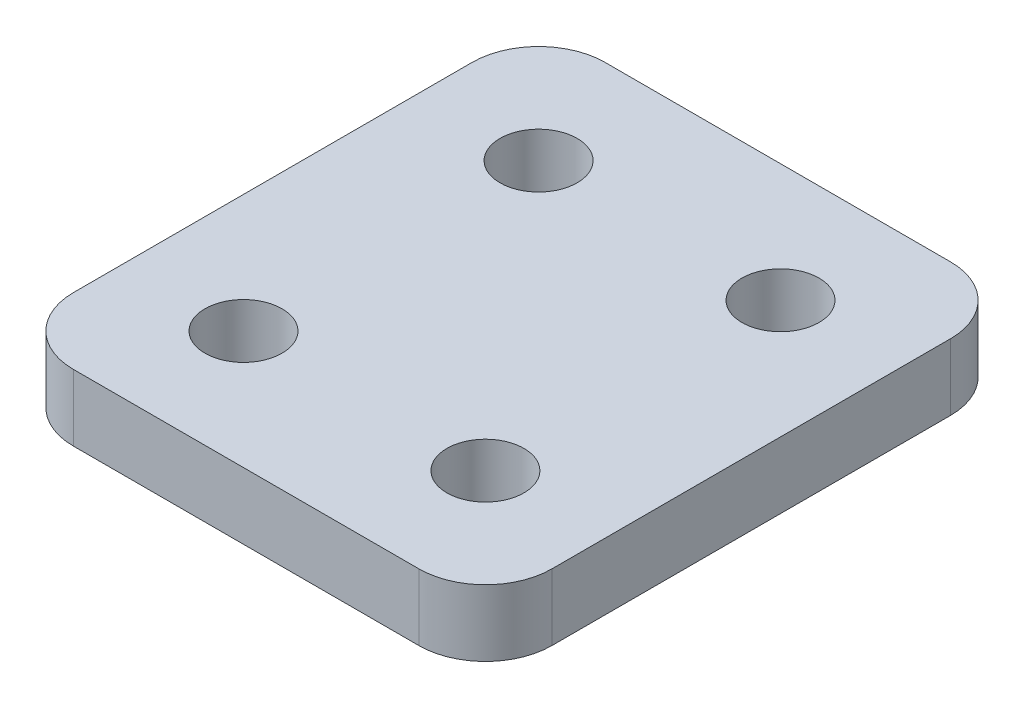
ISO-10303-21;
HEADER;
FILE_DESCRIPTION(('STEP AP214'),'2;1');
FILE_NAME('part.step','',(''),(''),'','','');
FILE_SCHEMA(('AUTOMOTIVE_DESIGN { 1 0 10303 214 1 1 1 1 }'));
ENDSEC;
DATA;
#1=APPLICATION_CONTEXT('core data for automotive mechanical design processes');
#2=APPLICATION_PROTOCOL_DEFINITION('international standard','automotive_design',2000,#1);
#3=PRODUCT_CONTEXT('',#1,'mechanical');
#4=PRODUCT('Part','Part','',(#3));
#5=PRODUCT_RELATED_PRODUCT_CATEGORY('part','',(#4));
#6=PRODUCT_DEFINITION_FORMATION('','',#4);
#7=PRODUCT_DEFINITION_CONTEXT('part definition',#1,'design');
#8=PRODUCT_DEFINITION('design','',#6,#7);
#9=PRODUCT_DEFINITION_SHAPE('','',#8);
#10=(LENGTH_UNIT() NAMED_UNIT(*) SI_UNIT(.MILLI.,.METRE.));
#11=(NAMED_UNIT(*) PLANE_ANGLE_UNIT() SI_UNIT($,.RADIAN.));
#12=(NAMED_UNIT(*) SI_UNIT($,.STERADIAN.) SOLID_ANGLE_UNIT());
#13=UNCERTAINTY_MEASURE_WITH_UNIT(LENGTH_MEASURE(1.E-05),#10,'distance_accuracy_value','');
#14=(GEOMETRIC_REPRESENTATION_CONTEXT(3) GLOBAL_UNCERTAINTY_ASSIGNED_CONTEXT((#13)) GLOBAL_UNIT_ASSIGNED_CONTEXT((#10,
#11,#12)) REPRESENTATION_CONTEXT('',''));
#15=CARTESIAN_POINT('',(0.,0.,0.));
#16=DIRECTION('',(0.,0.,1.));
#17=DIRECTION('',(1.,0.,0.));
#18=AXIS2_PLACEMENT_3D('',#15,#16,#17);
#19=CARTESIAN_POINT('',(9.144,2.54,10.16));
#20=DIRECTION('',(-1.,0.,0.));
#21=DIRECTION('',(0.,0.,1.));
#22=AXIS2_PLACEMENT_3D('',#19,#20,#21);
#23=PLANE('',#22);
#24=DIRECTION('',(0.,0.,-1.));
#25=VECTOR('',#24,1.);
#26=CARTESIAN_POINT('',(9.144,0.,10.16));
#27=LINE('',#26,#25);
#28=CARTESIAN_POINT('',(9.144,0.,7.62));
#29=VERTEX_POINT('',#28);
#30=CARTESIAN_POINT('',(9.144,0.,-7.62));
#31=VERTEX_POINT('',#30);
#32=EDGE_CURVE('E165',#29,#31,#27,.T.);
#33=ORIENTED_EDGE('',*,*,#32,.T.);
#34=DIRECTION('',(0.,-1.,0.));
#35=VECTOR('',#34,1.);
#36=CARTESIAN_POINT('',(9.144,2.54,-7.62));
#37=LINE('',#36,#35);
#38=CARTESIAN_POINT('',(9.144,2.54,-7.62));
#39=VERTEX_POINT('',#38);
#40=EDGE_CURVE('E11',#31,#39,#37,.F.);
#41=ORIENTED_EDGE('',*,*,#40,.T.);
#42=DIRECTION('',(0.,0.,-1.));
#43=VECTOR('',#42,1.);
#44=CARTESIAN_POINT('',(9.144,2.54,10.16));
#45=LINE('',#44,#43);
#46=CARTESIAN_POINT('',(9.144,2.54,7.62));
#47=VERTEX_POINT('',#46);
#48=EDGE_CURVE('E133',#47,#39,#45,.T.);
#49=ORIENTED_EDGE('',*,*,#48,.F.);
#50=DIRECTION('',(0.,-1.,0.));
#51=VECTOR('',#50,1.);
#52=CARTESIAN_POINT('',(9.144,2.54,7.62));
#53=LINE('',#52,#51);
#54=EDGE_CURVE('E49',#47,#29,#53,.T.);
#55=ORIENTED_EDGE('',*,*,#54,.T.);
#56=EDGE_LOOP('',(#33,#41,#49,#55));
#57=FACE_BOUND('',#56,.T.);
#58=ADVANCED_FACE('F41',(#57),#23,.F.);
#59=CARTESIAN_POINT('',(-9.144,2.54,-10.16));
#60=DIRECTION('',(0.,0.,1.));
#61=DIRECTION('',(1.,0.,0.));
#62=AXIS2_PLACEMENT_3D('',#59,#60,#61);
#63=PLANE('',#62);
#64=DIRECTION('',(-1.,0.,0.));
#65=VECTOR('',#64,1.);
#66=CARTESIAN_POINT('',(-9.144,0.,-10.16));
#67=LINE('',#66,#65);
#68=CARTESIAN_POINT('',(6.604,0.,-10.16));
#69=VERTEX_POINT('',#68);
#70=CARTESIAN_POINT('',(-6.604,0.,-10.16));
#71=VERTEX_POINT('',#70);
#72=EDGE_CURVE('E138',#69,#71,#67,.T.);
#73=ORIENTED_EDGE('',*,*,#72,.T.);
#74=DIRECTION('',(0.,-1.,0.));
#75=VECTOR('',#74,1.);
#76=CARTESIAN_POINT('',(-6.604,2.54,-10.16));
#77=LINE('',#76,#75);
#78=CARTESIAN_POINT('',(-6.604,2.54,-10.16));
#79=VERTEX_POINT('',#78);
#80=EDGE_CURVE('E56',#71,#79,#77,.F.);
#81=ORIENTED_EDGE('',*,*,#80,.T.);
#82=DIRECTION('',(-1.,0.,0.));
#83=VECTOR('',#82,1.);
#84=CARTESIAN_POINT('',(-9.144,2.54,-10.16));
#85=LINE('',#84,#83);
#86=CARTESIAN_POINT('',(6.604,2.54,-10.16));
#87=VERTEX_POINT('',#86);
#88=EDGE_CURVE('E136',#87,#79,#85,.T.);
#89=ORIENTED_EDGE('',*,*,#88,.F.);
#90=DIRECTION('',(0.,-1.,0.));
#91=VECTOR('',#90,1.);
#92=CARTESIAN_POINT('',(6.604,2.54,-10.16));
#93=LINE('',#92,#91);
#94=EDGE_CURVE('E157',#87,#69,#93,.T.);
#95=ORIENTED_EDGE('',*,*,#94,.T.);
#96=EDGE_LOOP('',(#73,#81,#89,#95));
#97=FACE_BOUND('',#96,.T.);
#98=ADVANCED_FACE('F217',(#97),#63,.F.);
#99=CARTESIAN_POINT('',(-9.144,2.54,10.16));
#100=DIRECTION('',(1.,0.,0.));
#101=DIRECTION('',(0.,0.,-1.));
#102=AXIS2_PLACEMENT_3D('',#99,#100,#101);
#103=PLANE('',#102);
#104=DIRECTION('',(0.,0.,1.));
#105=VECTOR('',#104,1.);
#106=CARTESIAN_POINT('',(-9.144,0.,10.16));
#107=LINE('',#106,#105);
#108=CARTESIAN_POINT('',(-9.144,0.,-7.62));
#109=VERTEX_POINT('',#108);
#110=CARTESIAN_POINT('',(-9.144,0.,7.62));
#111=VERTEX_POINT('',#110);
#112=EDGE_CURVE('E134',#109,#111,#107,.T.);
#113=ORIENTED_EDGE('',*,*,#112,.T.);
#114=DIRECTION('',(0.,-1.,0.));
#115=VECTOR('',#114,1.);
#116=CARTESIAN_POINT('',(-9.144,2.54,7.62));
#117=LINE('',#116,#115);
#118=CARTESIAN_POINT('',(-9.144,2.54,7.62));
#119=VERTEX_POINT('',#118);
#120=EDGE_CURVE('E112',#111,#119,#117,.F.);
#121=ORIENTED_EDGE('',*,*,#120,.T.);
#122=DIRECTION('',(0.,0.,1.));
#123=VECTOR('',#122,1.);
#124=CARTESIAN_POINT('',(-9.144,2.54,10.16));
#125=LINE('',#124,#123);
#126=CARTESIAN_POINT('',(-9.144,2.54,-7.62));
#127=VERTEX_POINT('',#126);
#128=EDGE_CURVE('E177',#127,#119,#125,.T.);
#129=ORIENTED_EDGE('',*,*,#128,.F.);
#130=DIRECTION('',(0.,-1.,0.));
#131=VECTOR('',#130,1.);
#132=CARTESIAN_POINT('',(-9.144,2.54,-7.62));
#133=LINE('',#132,#131);
#134=EDGE_CURVE('E117',#127,#109,#133,.T.);
#135=ORIENTED_EDGE('',*,*,#134,.T.);
#136=EDGE_LOOP('',(#113,#121,#129,#135));
#137=FACE_BOUND('',#136,.T.);
#138=ADVANCED_FACE('F214',(#137),#103,.F.);
#139=CARTESIAN_POINT('',(-9.144,2.54,10.16));
#140=DIRECTION('',(0.,0.,-1.));
#141=DIRECTION('',(-1.,0.,0.));
#142=AXIS2_PLACEMENT_3D('',#139,#140,#141);
#143=PLANE('',#142);
#144=DIRECTION('',(1.,0.,0.));
#145=VECTOR('',#144,1.);
#146=CARTESIAN_POINT('',(-9.144,2.54,10.16));
#147=LINE('',#146,#145);
#148=CARTESIAN_POINT('',(-6.604,2.54,10.16));
#149=VERTEX_POINT('',#148);
#150=CARTESIAN_POINT('',(6.604,2.54,10.16));
#151=VERTEX_POINT('',#150);
#152=EDGE_CURVE('E127',#149,#151,#147,.T.);
#153=ORIENTED_EDGE('',*,*,#152,.F.);
#154=DIRECTION('',(0.,-1.,0.));
#155=VECTOR('',#154,1.);
#156=CARTESIAN_POINT('',(-6.604,2.54,10.16));
#157=LINE('',#156,#155);
#158=CARTESIAN_POINT('',(-6.604,0.,10.16));
#159=VERTEX_POINT('',#158);
#160=EDGE_CURVE('E111',#149,#159,#157,.T.);
#161=ORIENTED_EDGE('',*,*,#160,.T.);
#162=DIRECTION('',(1.,0.,0.));
#163=VECTOR('',#162,1.);
#164=CARTESIAN_POINT('',(-9.144,0.,10.16));
#165=LINE('',#164,#163);
#166=CARTESIAN_POINT('',(6.604,0.,10.16));
#167=VERTEX_POINT('',#166);
#168=EDGE_CURVE('E124',#159,#167,#165,.T.);
#169=ORIENTED_EDGE('',*,*,#168,.T.);
#170=DIRECTION('',(0.,-1.,0.));
#171=VECTOR('',#170,1.);
#172=CARTESIAN_POINT('',(6.604,2.54,10.16));
#173=LINE('',#172,#171);
#174=EDGE_CURVE('E129',#167,#151,#173,.F.);
#175=ORIENTED_EDGE('',*,*,#174,.T.);
#176=EDGE_LOOP('',(#153,#161,#169,#175));
#177=FACE_BOUND('',#176,.T.);
#178=ADVANCED_FACE('F123',(#177),#143,.F.);
#179=CARTESIAN_POINT('',(0.,2.54,0.));
#180=DIRECTION('',(0.,-1.,0.));
#181=DIRECTION('',(0.,0.,-1.));
#182=AXIS2_PLACEMENT_3D('',#179,#180,#181);
#183=PLANE('',#182);
#184=CARTESIAN_POINT('',(4.6228,2.54,-5.6388));
#185=DIRECTION('',(0.,1.,0.));
#186=DIRECTION('',(0.,0.,-1.));
#187=AXIS2_PLACEMENT_3D('',#184,#185,#186);
#188=CIRCLE('',#187,1.4732);
#189=CARTESIAN_POINT('',(4.6228,2.54,-7.112));
#190=VERTEX_POINT('',#189);
#191=EDGE_CURVE('E187',#190,#190,#188,.T.);
#192=ORIENTED_EDGE('',*,*,#191,.F.);
#193=EDGE_LOOP('',(#192));
#194=FACE_BOUND('',#193,.T.);
#195=CARTESIAN_POINT('',(4.6228,2.54,5.6388));
#196=DIRECTION('',(0.,1.,0.));
#197=DIRECTION('',(0.,0.,1.));
#198=AXIS2_PLACEMENT_3D('',#195,#196,#197);
#199=CIRCLE('',#198,1.4732);
#200=CARTESIAN_POINT('',(4.6228,2.54,7.112));
#201=VERTEX_POINT('',#200);
#202=EDGE_CURVE('E193',#201,#201,#199,.T.);
#203=ORIENTED_EDGE('',*,*,#202,.F.);
#204=EDGE_LOOP('',(#203));
#205=FACE_BOUND('',#204,.T.);
#206=CARTESIAN_POINT('',(-4.6228,2.54,5.6388));
#207=DIRECTION('',(0.,1.,0.));
#208=DIRECTION('',(0.,0.,-1.));
#209=AXIS2_PLACEMENT_3D('',#206,#207,#208);
#210=CIRCLE('',#209,1.4732);
#211=CARTESIAN_POINT('',(-4.6228,2.54,4.1656));
#212=VERTEX_POINT('',#211);
#213=EDGE_CURVE('E182',#212,#212,#210,.T.);
#214=ORIENTED_EDGE('',*,*,#213,.F.);
#215=EDGE_LOOP('',(#214));
#216=FACE_BOUND('',#215,.T.);
#217=CARTESIAN_POINT('',(-4.6228,2.54,-5.6388));
#218=DIRECTION('',(0.,1.,0.));
#219=DIRECTION('',(0.,0.,1.));
#220=AXIS2_PLACEMENT_3D('',#217,#218,#219);
#221=CIRCLE('',#220,1.4732);
#222=CARTESIAN_POINT('',(-4.6228,2.54,-4.1656));
#223=VERTEX_POINT('',#222);
#224=EDGE_CURVE('E173',#223,#223,#221,.T.);
#225=ORIENTED_EDGE('',*,*,#224,.F.);
#226=EDGE_LOOP('',(#225));
#227=FACE_BOUND('',#226,.T.);
#228=ORIENTED_EDGE('',*,*,#128,.T.);
#229=CARTESIAN_POINT('',(-6.604,2.54,7.62));
#230=DIRECTION('',(0.,-1.,0.));
#231=DIRECTION('',(0.,0.,-1.));
#232=AXIS2_PLACEMENT_3D('',#229,#230,#231);
#233=CIRCLE('',#232,2.54);
#234=EDGE_CURVE('E155',#119,#149,#233,.F.);
#235=ORIENTED_EDGE('',*,*,#234,.T.);
#236=ORIENTED_EDGE('',*,*,#152,.T.);
#237=CARTESIAN_POINT('',(6.604,2.54,7.62));
#238=DIRECTION('',(0.,-1.,0.));
#239=DIRECTION('',(0.,0.,-1.));
#240=AXIS2_PLACEMENT_3D('',#237,#238,#239);
#241=CIRCLE('',#240,2.54);
#242=EDGE_CURVE('E150',#151,#47,#241,.F.);
#243=ORIENTED_EDGE('',*,*,#242,.T.);
#244=ORIENTED_EDGE('',*,*,#48,.T.);
#245=CARTESIAN_POINT('',(6.604,2.54,-7.62));
#246=DIRECTION('',(0.,-1.,0.));
#247=DIRECTION('',(0.,0.,-1.));
#248=AXIS2_PLACEMENT_3D('',#245,#246,#247);
#249=CIRCLE('',#248,2.54);
#250=EDGE_CURVE('E63',#39,#87,#249,.F.);
#251=ORIENTED_EDGE('',*,*,#250,.T.);
#252=ORIENTED_EDGE('',*,*,#88,.T.);
#253=CARTESIAN_POINT('',(-6.604,2.54,-7.62));
#254=DIRECTION('',(0.,-1.,0.));
#255=DIRECTION('',(0.,0.,-1.));
#256=AXIS2_PLACEMENT_3D('',#253,#254,#255);
#257=CIRCLE('',#256,2.54);
#258=EDGE_CURVE('E153',#79,#127,#257,.F.);
#259=ORIENTED_EDGE('',*,*,#258,.T.);
#260=EDGE_LOOP('',(#228,#235,#236,#243,#244,#251,#252,#259));
#261=FACE_BOUND('',#260,.T.);
#262=ADVANCED_FACE('F204',(#194,#205,#216,#227,#261),#183,.F.);
#263=CARTESIAN_POINT('',(0.,0.,0.));
#264=DIRECTION('',(0.,-1.,0.));
#265=DIRECTION('',(0.,0.,-1.));
#266=AXIS2_PLACEMENT_3D('',#263,#264,#265);
#267=PLANE('',#266);
#268=CARTESIAN_POINT('',(4.6228,0.,-5.6388));
#269=DIRECTION('',(0.,1.,0.));
#270=DIRECTION('',(0.,0.,-1.));
#271=AXIS2_PLACEMENT_3D('',#268,#269,#270);
#272=CIRCLE('',#271,1.4732);
#273=CARTESIAN_POINT('',(4.6228,0.,-7.112));
#274=VERTEX_POINT('',#273);
#275=EDGE_CURVE('E184',#274,#274,#272,.T.);
#276=ORIENTED_EDGE('',*,*,#275,.T.);
#277=EDGE_LOOP('',(#276));
#278=FACE_BOUND('',#277,.T.);
#279=CARTESIAN_POINT('',(4.6228,0.,5.6388));
#280=DIRECTION('',(0.,1.,0.));
#281=DIRECTION('',(0.,0.,1.));
#282=AXIS2_PLACEMENT_3D('',#279,#280,#281);
#283=CIRCLE('',#282,1.4732);
#284=CARTESIAN_POINT('',(4.6228,0.,7.112));
#285=VERTEX_POINT('',#284);
#286=EDGE_CURVE('E190',#285,#285,#283,.T.);
#287=ORIENTED_EDGE('',*,*,#286,.T.);
#288=EDGE_LOOP('',(#287));
#289=FACE_BOUND('',#288,.T.);
#290=CARTESIAN_POINT('',(-4.6228,0.,5.6388));
#291=DIRECTION('',(0.,1.,0.));
#292=DIRECTION('',(0.,0.,-1.));
#293=AXIS2_PLACEMENT_3D('',#290,#291,#292);
#294=CIRCLE('',#293,1.4732);
#295=CARTESIAN_POINT('',(-4.6228,0.,4.1656));
#296=VERTEX_POINT('',#295);
#297=EDGE_CURVE('E196',#296,#296,#294,.T.);
#298=ORIENTED_EDGE('',*,*,#297,.T.);
#299=EDGE_LOOP('',(#298));
#300=FACE_BOUND('',#299,.T.);
#301=CARTESIAN_POINT('',(-4.6228,0.,-5.6388));
#302=DIRECTION('',(0.,1.,0.));
#303=DIRECTION('',(0.,0.,1.));
#304=AXIS2_PLACEMENT_3D('',#301,#302,#303);
#305=CIRCLE('',#304,1.4732);
#306=CARTESIAN_POINT('',(-4.6228,0.,-4.1656));
#307=VERTEX_POINT('',#306);
#308=EDGE_CURVE('E170',#307,#307,#305,.T.);
#309=ORIENTED_EDGE('',*,*,#308,.T.);
#310=EDGE_LOOP('',(#309));
#311=FACE_BOUND('',#310,.T.);
#312=ORIENTED_EDGE('',*,*,#168,.F.);
#313=CARTESIAN_POINT('',(-6.604,0.,7.62));
#314=DIRECTION('',(0.,-1.,0.));
#315=DIRECTION('',(0.,0.,-1.));
#316=AXIS2_PLACEMENT_3D('',#313,#314,#315);
#317=CIRCLE('',#316,2.54);
#318=EDGE_CURVE('E107',#159,#111,#317,.T.);
#319=ORIENTED_EDGE('',*,*,#318,.T.);
#320=ORIENTED_EDGE('',*,*,#112,.F.);
#321=CARTESIAN_POINT('',(-6.604,0.,-7.62));
#322=DIRECTION('',(0.,-1.,0.));
#323=DIRECTION('',(0.,0.,-1.));
#324=AXIS2_PLACEMENT_3D('',#321,#322,#323);
#325=CIRCLE('',#324,2.54);
#326=EDGE_CURVE('E118',#109,#71,#325,.T.);
#327=ORIENTED_EDGE('',*,*,#326,.T.);
#328=ORIENTED_EDGE('',*,*,#72,.F.);
#329=CARTESIAN_POINT('',(6.604,0.,-7.62));
#330=DIRECTION('',(0.,-1.,0.));
#331=DIRECTION('',(0.,0.,-1.));
#332=AXIS2_PLACEMENT_3D('',#329,#330,#331);
#333=CIRCLE('',#332,2.54);
#334=EDGE_CURVE('E144',#69,#31,#333,.T.);
#335=ORIENTED_EDGE('',*,*,#334,.T.);
#336=ORIENTED_EDGE('',*,*,#32,.F.);
#337=CARTESIAN_POINT('',(6.604,0.,7.62));
#338=DIRECTION('',(0.,-1.,0.));
#339=DIRECTION('',(0.,0.,-1.));
#340=AXIS2_PLACEMENT_3D('',#337,#338,#339);
#341=CIRCLE('',#340,2.54);
#342=EDGE_CURVE('E128',#29,#167,#341,.T.);
#343=ORIENTED_EDGE('',*,*,#342,.T.);
#344=EDGE_LOOP('',(#312,#319,#320,#327,#328,#335,#336,#343));
#345=FACE_BOUND('',#344,.T.);
#346=ADVANCED_FACE('F131',(#278,#289,#300,#311,#345),#267,.T.);
#347=CARTESIAN_POINT('',(-4.6228,0.,-5.6388));
#348=DIRECTION('',(0.,1.,0.));
#349=DIRECTION('',(0.,0.,1.));
#350=AXIS2_PLACEMENT_3D('',#347,#348,#349);
#351=CYLINDRICAL_SURFACE('',#350,1.4732);
#352=ORIENTED_EDGE('',*,*,#308,.F.);
#353=EDGE_LOOP('',(#352));
#354=FACE_BOUND('',#353,.T.);
#355=ORIENTED_EDGE('',*,*,#224,.T.);
#356=EDGE_LOOP('',(#355));
#357=FACE_BOUND('',#356,.T.);
#358=ADVANCED_FACE('F282',(#354,#357),#351,.F.);
#359=CARTESIAN_POINT('',(-4.6228,0.,5.6388));
#360=DIRECTION('',(0.,1.,0.));
#361=DIRECTION('',(0.,0.,1.));
#362=AXIS2_PLACEMENT_3D('',#359,#360,#361);
#363=CYLINDRICAL_SURFACE('',#362,1.4732);
#364=ORIENTED_EDGE('',*,*,#297,.F.);
#365=EDGE_LOOP('',(#364));
#366=FACE_BOUND('',#365,.T.);
#367=ORIENTED_EDGE('',*,*,#213,.T.);
#368=EDGE_LOOP('',(#367));
#369=FACE_BOUND('',#368,.T.);
#370=ADVANCED_FACE('F202',(#366,#369),#363,.F.);
#371=CARTESIAN_POINT('',(4.6228,0.,5.6388));
#372=DIRECTION('',(0.,1.,0.));
#373=DIRECTION('',(0.,0.,1.));
#374=AXIS2_PLACEMENT_3D('',#371,#372,#373);
#375=CYLINDRICAL_SURFACE('',#374,1.4732);
#376=ORIENTED_EDGE('',*,*,#286,.F.);
#377=EDGE_LOOP('',(#376));
#378=FACE_BOUND('',#377,.T.);
#379=ORIENTED_EDGE('',*,*,#202,.T.);
#380=EDGE_LOOP('',(#379));
#381=FACE_BOUND('',#380,.T.);
#382=ADVANCED_FACE('F265',(#378,#381),#375,.F.);
#383=CARTESIAN_POINT('',(4.6228,0.,-5.6388));
#384=DIRECTION('',(0.,1.,0.));
#385=DIRECTION('',(0.,0.,1.));
#386=AXIS2_PLACEMENT_3D('',#383,#384,#385);
#387=CYLINDRICAL_SURFACE('',#386,1.4732);
#388=ORIENTED_EDGE('',*,*,#275,.F.);
#389=EDGE_LOOP('',(#388));
#390=FACE_BOUND('',#389,.T.);
#391=ORIENTED_EDGE('',*,*,#191,.T.);
#392=EDGE_LOOP('',(#391));
#393=FACE_BOUND('',#392,.T.);
#394=ADVANCED_FACE('F236',(#390,#393),#387,.F.);
#395=CARTESIAN_POINT('',(-6.604,2.54,7.62));
#396=DIRECTION('',(0.,-1.,0.));
#397=DIRECTION('',(0.,0.,-1.));
#398=AXIS2_PLACEMENT_3D('',#395,#396,#397);
#399=CYLINDRICAL_SURFACE('',#398,2.54);
#400=ORIENTED_EDGE('',*,*,#234,.F.);
#401=ORIENTED_EDGE('',*,*,#120,.F.);
#402=ORIENTED_EDGE('',*,*,#318,.F.);
#403=ORIENTED_EDGE('',*,*,#160,.F.);
#404=EDGE_LOOP('',(#400,#401,#402,#403));
#405=FACE_BOUND('',#404,.T.);
#406=ADVANCED_FACE('F110',(#405),#399,.T.);
#407=CARTESIAN_POINT('',(-6.604,2.54,-7.62));
#408=DIRECTION('',(0.,-1.,0.));
#409=DIRECTION('',(0.,0.,-1.));
#410=AXIS2_PLACEMENT_3D('',#407,#408,#409);
#411=CYLINDRICAL_SURFACE('',#410,2.54);
#412=ORIENTED_EDGE('',*,*,#258,.F.);
#413=ORIENTED_EDGE('',*,*,#80,.F.);
#414=ORIENTED_EDGE('',*,*,#326,.F.);
#415=ORIENTED_EDGE('',*,*,#134,.F.);
#416=EDGE_LOOP('',(#412,#413,#414,#415));
#417=FACE_BOUND('',#416,.T.);
#418=ADVANCED_FACE('F216',(#417),#411,.T.);
#419=CARTESIAN_POINT('',(6.604,2.54,-7.62));
#420=DIRECTION('',(0.,-1.,0.));
#421=DIRECTION('',(0.,0.,-1.));
#422=AXIS2_PLACEMENT_3D('',#419,#420,#421);
#423=CYLINDRICAL_SURFACE('',#422,2.54);
#424=ORIENTED_EDGE('',*,*,#250,.F.);
#425=ORIENTED_EDGE('',*,*,#40,.F.);
#426=ORIENTED_EDGE('',*,*,#334,.F.);
#427=ORIENTED_EDGE('',*,*,#94,.F.);
#428=EDGE_LOOP('',(#424,#425,#426,#427));
#429=FACE_BOUND('',#428,.T.);
#430=ADVANCED_FACE('F220',(#429),#423,.T.);
#431=CARTESIAN_POINT('',(6.604,2.54,7.62));
#432=DIRECTION('',(0.,-1.,0.));
#433=DIRECTION('',(0.,0.,-1.));
#434=AXIS2_PLACEMENT_3D('',#431,#432,#433);
#435=CYLINDRICAL_SURFACE('',#434,2.54);
#436=ORIENTED_EDGE('',*,*,#242,.F.);
#437=ORIENTED_EDGE('',*,*,#174,.F.);
#438=ORIENTED_EDGE('',*,*,#342,.F.);
#439=ORIENTED_EDGE('',*,*,#54,.F.);
#440=EDGE_LOOP('',(#436,#437,#438,#439));
#441=FACE_BOUND('',#440,.T.);
#442=ADVANCED_FACE('F43',(#441),#435,.T.);
#443=CLOSED_SHELL('',(#58,#98,#138,#178,#262,#346,#358,#370,#382,#394,#406,#418,#430,#442));
#444=MANIFOLD_SOLID_BREP('B2',#443);
#445=ADVANCED_BREP_SHAPE_REPRESENTATION('',(#18,#444),#14);
#446=SHAPE_DEFINITION_REPRESENTATION(#9,#445);
ENDSEC;
END-ISO-10303-21;
